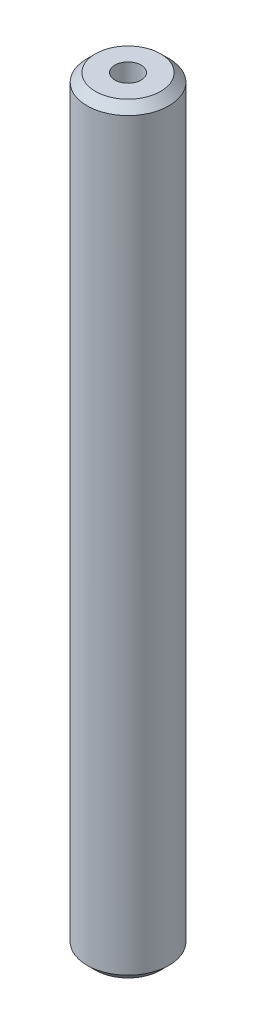
ISO-10303-21;
HEADER;
FILE_DESCRIPTION(('STEP AP214'),'2;1');
FILE_NAME('part.step','',(''),(''),'','','');
FILE_SCHEMA(('AUTOMOTIVE_DESIGN { 1 0 10303 214 1 1 1 1 }'));
ENDSEC;
DATA;
#1=APPLICATION_CONTEXT('core data for automotive mechanical design processes');
#2=APPLICATION_PROTOCOL_DEFINITION('international standard','automotive_design',2000,#1);
#3=PRODUCT_CONTEXT('',#1,'mechanical');
#4=PRODUCT('Part','Part','',(#3));
#5=PRODUCT_RELATED_PRODUCT_CATEGORY('part','',(#4));
#6=PRODUCT_DEFINITION_FORMATION('','',#4);
#7=PRODUCT_DEFINITION_CONTEXT('part definition',#1,'design');
#8=PRODUCT_DEFINITION('design','',#6,#7);
#9=PRODUCT_DEFINITION_SHAPE('','',#8);
#10=(LENGTH_UNIT() NAMED_UNIT(*) SI_UNIT(.MILLI.,.METRE.));
#11=(NAMED_UNIT(*) PLANE_ANGLE_UNIT() SI_UNIT($,.RADIAN.));
#12=(NAMED_UNIT(*) SI_UNIT($,.STERADIAN.) SOLID_ANGLE_UNIT());
#13=UNCERTAINTY_MEASURE_WITH_UNIT(LENGTH_MEASURE(1.E-05),#10,'distance_accuracy_value','');
#14=(GEOMETRIC_REPRESENTATION_CONTEXT(3) GLOBAL_UNCERTAINTY_ASSIGNED_CONTEXT((#13)) GLOBAL_UNIT_ASSIGNED_CONTEXT((#10,
#11,#12)) REPRESENTATION_CONTEXT('',''));
#15=CARTESIAN_POINT('',(0.,0.,0.));
#16=DIRECTION('',(0.,0.,1.));
#17=DIRECTION('',(1.,0.,0.));
#18=AXIS2_PLACEMENT_3D('',#15,#16,#17);
#19=CARTESIAN_POINT('',(0.,464.819685033356,0.));
#20=DIRECTION('',(0.,-1.,0.));
#21=DIRECTION('',(0.,0.,-1.));
#22=AXIS2_PLACEMENT_3D('',#19,#20,#21);
#23=CYLINDRICAL_SURFACE('',#22,25.);
#24=CARTESIAN_POINT('',(0.,459.739417993964,0.));
#25=DIRECTION('',(0.,1.,0.));
#26=DIRECTION('',(0.,0.,1.));
#27=AXIS2_PLACEMENT_3D('',#24,#25,#26);
#28=CIRCLE('',#27,25.);
#29=CARTESIAN_POINT('',(0.,459.739417993964,-25.));
#30=VERTEX_POINT('',#29);
#31=EDGE_CURVE('E50',#30,#30,#28,.F.);
#32=CARTESIAN_POINT('',(0.,5.08026703939218,0.));
#33=DIRECTION('',(0.,1.,0.));
#34=DIRECTION('',(0.,0.,1.));
#35=AXIS2_PLACEMENT_3D('',#32,#33,#34);
#36=CIRCLE('',#35,25.);
#37=CARTESIAN_POINT('',(0.,5.08026703939218,-25.));
#38=VERTEX_POINT('',#37);
#39=EDGE_CURVE('E51',#38,#38,#36,.T.);
#40=CARTESIAN_POINT('',(0.,459.739417993964,-25.));
#41=CARTESIAN_POINT('',(0.,455.003385171521,-25.));
#42=CARTESIAN_POINT('',(0.,450.267352349077,-25.));
#43=CARTESIAN_POINT('',(0.,440.79528670419,-25.));
#44=CARTESIAN_POINT('',(0.,436.059253881747,-25.));
#45=CARTESIAN_POINT('',(0.,426.58718823686,-25.));
#46=CARTESIAN_POINT('',(0.,421.851155414416,-25.));
#47=CARTESIAN_POINT('',(0.,412.379089769529,-25.));
#48=CARTESIAN_POINT('',(0.,407.643056947086,-25.));
#49=CARTESIAN_POINT('',(0.,398.170991302199,-25.));
#50=CARTESIAN_POINT('',(0.,393.434958479756,-25.));
#51=CARTESIAN_POINT('',(0.,383.962892834869,-25.));
#52=CARTESIAN_POINT('',(0.,379.226860012425,-25.));
#53=CARTESIAN_POINT('',(0.,369.754794367538,-25.));
#54=CARTESIAN_POINT('',(0.,365.018761545095,-25.));
#55=CARTESIAN_POINT('',(0.,355.546695900208,-25.));
#56=CARTESIAN_POINT('',(0.,350.810663077765,-25.));
#57=CARTESIAN_POINT('',(0.,341.338597432878,-25.));
#58=CARTESIAN_POINT('',(0.,336.602564610434,-25.));
#59=CARTESIAN_POINT('',(0.,327.130498965547,-25.));
#60=CARTESIAN_POINT('',(0.,322.394466143104,-25.));
#61=CARTESIAN_POINT('',(0.,312.922400498217,-25.));
#62=CARTESIAN_POINT('',(0.,308.186367675773,-25.));
#63=CARTESIAN_POINT('',(0.,298.714302030887,-25.));
#64=CARTESIAN_POINT('',(0.,293.978269208443,-25.));
#65=CARTESIAN_POINT('',(0.,284.506203563556,-25.));
#66=CARTESIAN_POINT('',(0.,279.770170741113,-25.));
#67=CARTESIAN_POINT('',(0.,270.298105096226,-25.));
#68=CARTESIAN_POINT('',(0.,265.562072273782,-25.));
#69=CARTESIAN_POINT('',(0.,256.090006628895,-25.));
#70=CARTESIAN_POINT('',(0.,251.353973806452,-25.));
#71=CARTESIAN_POINT('',(0.,241.881908161565,-25.));
#72=CARTESIAN_POINT('',(0.,237.145875339122,-25.));
#73=CARTESIAN_POINT('',(0.,227.673809694235,-25.));
#74=CARTESIAN_POINT('',(0.,222.937776871791,-25.));
#75=CARTESIAN_POINT('',(0.,213.465711226904,-25.));
#76=CARTESIAN_POINT('',(0.,208.729678404461,-25.));
#77=CARTESIAN_POINT('',(0.,199.257612759574,-25.));
#78=CARTESIAN_POINT('',(0.,194.52157993713,-25.));
#79=CARTESIAN_POINT('',(0.,185.049514292244,-25.));
#80=CARTESIAN_POINT('',(0.,180.3134814698,-25.));
#81=CARTESIAN_POINT('',(0.,170.841415824913,-25.));
#82=CARTESIAN_POINT('',(0.,166.10538300247,-25.));
#83=CARTESIAN_POINT('',(0.,156.633317357583,-25.));
#84=CARTESIAN_POINT('',(0.,151.897284535139,-25.));
#85=CARTESIAN_POINT('',(0.,142.425218890252,-25.));
#86=CARTESIAN_POINT('',(0.,137.689186067809,-25.));
#87=CARTESIAN_POINT('',(0.,128.217120422922,-25.));
#88=CARTESIAN_POINT('',(0.,123.481087600479,-25.));
#89=CARTESIAN_POINT('',(0.,114.009021955592,-25.));
#90=CARTESIAN_POINT('',(0.,109.272989133148,-25.));
#91=CARTESIAN_POINT('',(0.,99.8009234882613,-25.));
#92=CARTESIAN_POINT('',(0.,95.0648906658179,-25.));
#93=CARTESIAN_POINT('',(0.,85.5928250209309,-25.));
#94=CARTESIAN_POINT('',(0.,80.8567921984875,-25.));
#95=CARTESIAN_POINT('',(0.,71.3847265536006,-25.));
#96=CARTESIAN_POINT('',(0.,66.6486937311571,-25.));
#97=CARTESIAN_POINT('',(0.,57.1766280862702,-25.));
#98=CARTESIAN_POINT('',(0.,52.4405952638267,-25.));
#99=CARTESIAN_POINT('',(0.,42.9685296189398,-25.));
#100=CARTESIAN_POINT('',(0.,38.2324967964964,-25.));
#101=CARTESIAN_POINT('',(0.,28.7604311516095,-25.));
#102=CARTESIAN_POINT('',(0.,24.024398329166,-25.));
#103=CARTESIAN_POINT('',(0.,14.5523326842791,-25.));
#104=CARTESIAN_POINT('',(0.,9.81629986183563,-25.));
#105=CARTESIAN_POINT('',(0.,5.08026703939218,-25.));
#106=B_SPLINE_CURVE_WITH_KNOTS('',3,(#40,#41,#42,#43,#44,#45,#46,#47,#48,#49,#50,#51,#52,#53,
#54,#55,#56,#57,#58,#59,#60,#61,#62,#63,#64,#65,#66,#67,#68,#69,#70,#71,#72,#73,#74,#75,#76,#77,
#78,#79,#80,#81,#82,#83,#84,#85,#86,#87,#88,#89,#90,#91,#92,#93,#94,#95,#96,#97,#98,#99,#100,
#101,#102,#103,#104,#105),.UNSPECIFIED.,.F.,.F.,(4,2,2,2,2,2,2,2,2,2,2,2,2,2,2,2,2,2,2,2,2,2,2,
2,2,2,2,2,2,2,2,2,4),(0.,14.2080984673303,28.4161969346607,42.6242954019911,56.8323938693214,
71.0404923366518,85.2485908039822,99.4566892713125,113.664787738643,127.872886205973,
142.080984673304,156.289083140634,170.497181607964,184.705280075295,198.913378542625,
213.121477009955,227.329575477286,241.537673944616,255.745772411947,269.953870879277,
284.161969346607,298.370067813938,312.578166281268,326.786264748598,340.994363215929,
355.202461683259,369.41056015059,383.61865861792,397.82675708525,412.034855552581,
426.242954019911,440.451052487241,454.659150954572),.UNSPECIFIED.);
#107=EDGE_CURVE('BSEAM39',#30,#38,#106,.T.);
#108=ORIENTED_EDGE('',*,*,#31,.T.);
#109=ORIENTED_EDGE('',*,*,#39,.T.);
#110=ORIENTED_EDGE('',*,*,#107,.T.);
#111=ORIENTED_EDGE('',*,*,#107,.F.);
#112=EDGE_LOOP('',(#108,#110,#109,#111));
#113=FACE_BOUND('',#112,.T.);
#114=ADVANCED_FACE('F39',(#113),#23,.T.);
#115=CARTESIAN_POINT('',(0.,464.819685033356,0.));
#116=DIRECTION('',(0.,1.,0.));
#117=DIRECTION('',(0.,0.,1.));
#118=AXIS2_PLACEMENT_3D('',#115,#116,#117);
#119=PLANE('',#118);
#120=CARTESIAN_POINT('',(0.,464.819685033356,0.));
#121=DIRECTION('',(0.,1.,0.));
#122=DIRECTION('',(0.,0.,1.));
#123=AXIS2_PLACEMENT_3D('',#120,#121,#122);
#124=CIRCLE('',#123,19.9197329606084);
#125=CARTESIAN_POINT('',(0.,464.819685033356,19.9197329606084));
#126=VERTEX_POINT('',#125);
#127=EDGE_CURVE('E54',#126,#126,#124,.T.);
#128=ORIENTED_EDGE('',*,*,#127,.T.);
#129=EDGE_LOOP('',(#128));
#130=FACE_BOUND('',#129,.T.);
#131=CARTESIAN_POINT('',(0.,464.819685033356,0.));
#132=DIRECTION('',(0.,1.,0.));
#133=DIRECTION('',(0.,0.,1.));
#134=AXIS2_PLACEMENT_3D('',#131,#132,#133);
#135=CIRCLE('',#134,7.98255586034848);
#136=CARTESIAN_POINT('',(0.,464.819685033356,-7.98255586034848));
#137=VERTEX_POINT('',#136);
#138=EDGE_CURVE('E58',#137,#137,#135,.T.);
#139=ORIENTED_EDGE('',*,*,#138,.F.);
#140=EDGE_LOOP('',(#139));
#141=FACE_BOUND('',#140,.T.);
#142=ADVANCED_FACE('F69',(#130,#141),#119,.T.);
#143=CARTESIAN_POINT('',(0.,0.,0.));
#144=DIRECTION('',(0.,1.,0.));
#145=DIRECTION('',(0.,0.,1.));
#146=AXIS2_PLACEMENT_3D('',#143,#144,#145);
#147=PLANE('',#146);
#148=CARTESIAN_POINT('',(0.,0.,0.));
#149=DIRECTION('',(0.,1.,0.));
#150=DIRECTION('',(0.,0.,1.));
#151=AXIS2_PLACEMENT_3D('',#148,#149,#150);
#152=CIRCLE('',#151,19.9197329606078);
#153=CARTESIAN_POINT('',(0.,0.,19.9197329606078));
#154=VERTEX_POINT('',#153);
#155=EDGE_CURVE('E10',#154,#154,#152,.F.);
#156=ORIENTED_EDGE('',*,*,#155,.T.);
#157=EDGE_LOOP('',(#156));
#158=FACE_BOUND('',#157,.T.);
#159=CARTESIAN_POINT('',(0.,0.,0.));
#160=DIRECTION('',(0.,1.,0.));
#161=DIRECTION('',(0.,0.,1.));
#162=AXIS2_PLACEMENT_3D('',#159,#160,#161);
#163=CIRCLE('',#162,7.98255586034848);
#164=CARTESIAN_POINT('',(0.,0.,-7.98255586034848));
#165=VERTEX_POINT('',#164);
#166=EDGE_CURVE('E63',#165,#165,#163,.T.);
#167=ORIENTED_EDGE('',*,*,#166,.T.);
#168=EDGE_LOOP('',(#167));
#169=FACE_BOUND('',#168,.T.);
#170=ADVANCED_FACE('F75',(#158,#169),#147,.F.);
#171=CARTESIAN_POINT('',(0.,464.819685033356,0.));
#172=DIRECTION('',(0.,-1.,0.));
#173=DIRECTION('',(0.,0.,-1.));
#174=AXIS2_PLACEMENT_3D('',#171,#172,#173);
#175=CYLINDRICAL_SURFACE('',#174,7.98255586034848);
#176=CARTESIAN_POINT('',(0.,464.819685033356,-7.98255586034848));
#177=CARTESIAN_POINT('',(0.,459.977813314258,-7.98255586034848));
#178=CARTESIAN_POINT('',(0.,455.135941595161,-7.98255586034848));
#179=CARTESIAN_POINT('',(0.,445.452198156966,-7.98255586034848));
#180=CARTESIAN_POINT('',(0.,440.610326437868,-7.98255586034848));
#181=CARTESIAN_POINT('',(0.,430.926582999673,-7.98255586034848));
#182=CARTESIAN_POINT('',(0.,426.084711280576,-7.98255586034848));
#183=CARTESIAN_POINT('',(0.,416.400967842381,-7.98255586034848));
#184=CARTESIAN_POINT('',(0.,411.559096123284,-7.98255586034848));
#185=CARTESIAN_POINT('',(0.,401.875352685089,-7.98255586034848));
#186=CARTESIAN_POINT('',(0.,397.033480965991,-7.98255586034848));
#187=CARTESIAN_POINT('',(0.,387.349737527796,-7.98255586034848));
#188=CARTESIAN_POINT('',(0.,382.507865808699,-7.98255586034848));
#189=CARTESIAN_POINT('',(0.,372.824122370504,-7.98255586034848));
#190=CARTESIAN_POINT('',(0.,367.982250651406,-7.98255586034848));
#191=CARTESIAN_POINT('',(0.,358.298507213212,-7.98255586034848));
#192=CARTESIAN_POINT('',(0.,353.456635494114,-7.98255586034848));
#193=CARTESIAN_POINT('',(0.,343.772892055919,-7.98255586034848));
#194=CARTESIAN_POINT('',(0.,338.931020336822,-7.98255586034848));
#195=CARTESIAN_POINT('',(0.,329.247276898627,-7.98255586034848));
#196=CARTESIAN_POINT('',(0.,324.405405179529,-7.98255586034848));
#197=CARTESIAN_POINT('',(0.,314.721661741334,-7.98255586034848));
#198=CARTESIAN_POINT('',(0.,309.879790022237,-7.98255586034848));
#199=CARTESIAN_POINT('',(0.,300.196046584042,-7.98255586034848));
#200=CARTESIAN_POINT('',(0.,295.354174864945,-7.98255586034848));
#201=CARTESIAN_POINT('',(0.,285.67043142675,-7.98255586034848));
#202=CARTESIAN_POINT('',(0.,280.828559707652,-7.98255586034848));
#203=CARTESIAN_POINT('',(0.,271.144816269457,-7.98255586034848));
#204=CARTESIAN_POINT('',(0.,266.30294455036,-7.98255586034848));
#205=CARTESIAN_POINT('',(0.,256.619201112165,-7.98255586034848));
#206=CARTESIAN_POINT('',(0.,251.777329393068,-7.98255586034848));
#207=CARTESIAN_POINT('',(0.,242.093585954873,-7.98255586034848));
#208=CARTESIAN_POINT('',(0.,237.251714235775,-7.98255586034848));
#209=CARTESIAN_POINT('',(0.,227.56797079758,-7.98255586034848));
#210=CARTESIAN_POINT('',(0.,222.726099078483,-7.98255586034848));
#211=CARTESIAN_POINT('',(0.,213.042355640288,-7.98255586034848));
#212=CARTESIAN_POINT('',(0.,208.200483921191,-7.98255586034848));
#213=CARTESIAN_POINT('',(0.,198.516740482996,-7.98255586034848));
#214=CARTESIAN_POINT('',(0.,193.674868763898,-7.98255586034848));
#215=CARTESIAN_POINT('',(0.,183.991125325703,-7.98255586034848));
#216=CARTESIAN_POINT('',(0.,179.149253606606,-7.98255586034848));
#217=CARTESIAN_POINT('',(0.,169.465510168411,-7.98255586034848));
#218=CARTESIAN_POINT('',(0.,164.623638449313,-7.98255586034848));
#219=CARTESIAN_POINT('',(0.,154.939895011119,-7.98255586034848));
#220=CARTESIAN_POINT('',(0.,150.098023292021,-7.98255586034848));
#221=CARTESIAN_POINT('',(0.,140.414279853826,-7.98255586034848));
#222=CARTESIAN_POINT('',(0.,135.572408134729,-7.98255586034848));
#223=CARTESIAN_POINT('',(0.,125.888664696534,-7.98255586034848));
#224=CARTESIAN_POINT('',(0.,121.046792977436,-7.98255586034848));
#225=CARTESIAN_POINT('',(0.,111.363049539241,-7.98255586034848));
#226=CARTESIAN_POINT('',(0.,106.521177820144,-7.98255586034848));
#227=CARTESIAN_POINT('',(0.,96.8374343819491,-7.98255586034848));
#228=CARTESIAN_POINT('',(0.,91.9955626628516,-7.98255586034848));
#229=CARTESIAN_POINT('',(0.,82.3118192246567,-7.98255586034848));
#230=CARTESIAN_POINT('',(0.,77.4699475055592,-7.98255586034848));
#231=CARTESIAN_POINT('',(0.,67.7862040673643,-7.98255586034848));
#232=CARTESIAN_POINT('',(0.,62.9443323482669,-7.98255586034848));
#233=CARTESIAN_POINT('',(0.,53.260588910072,-7.98255586034848));
#234=CARTESIAN_POINT('',(0.,48.4187171909745,-7.98255586034848));
#235=CARTESIAN_POINT('',(0.,38.7349737527796,-7.98255586034848));
#236=CARTESIAN_POINT('',(0.,33.8931020336821,-7.98255586034848));
#237=CARTESIAN_POINT('',(0.,24.2093585954872,-7.98255586034848));
#238=CARTESIAN_POINT('',(0.,19.3674868763897,-7.98255586034848));
#239=CARTESIAN_POINT('',(0.,9.68374343819484,-7.98255586034848));
#240=CARTESIAN_POINT('',(0.,4.84187171909739,-7.98255586034848));
#241=CARTESIAN_POINT('',(0.,0.,-7.98255586034848));
#242=B_SPLINE_CURVE_WITH_KNOTS('',3,(#176,#177,#178,#179,#180,#181,#182,#183,#184,#185,#186,
#187,#188,#189,#190,#191,#192,#193,#194,#195,#196,#197,#198,#199,#200,#201,#202,#203,#204,#205,
#206,#207,#208,#209,#210,#211,#212,#213,#214,#215,#216,#217,#218,#219,#220,#221,#222,#223,#224,
#225,#226,#227,#228,#229,#230,#231,#232,#233,#234,#235,#236,#237,#238,#239,#240,#241),
.UNSPECIFIED.,.F.,.F.,(4,2,2,2,2,2,2,2,2,2,2,2,2,2,2,2,2,2,2,2,2,2,2,2,2,2,2,2,2,2,2,2,4),(0.,
14.5256151572924,29.0512303145847,43.5768454718771,58.1024606291695,72.6280757864618,
87.1536909437542,101.679306101047,116.204921258339,130.730536415631,145.256151572924,
159.781766730216,174.307381887508,188.832997044801,203.358612202093,217.884227359385,
232.409842516678,246.93545767397,261.461072831263,275.986687988555,290.512303145847,
305.03791830314,319.563533460432,334.089148617724,348.614763775017,363.140378932309,
377.665994089601,392.191609246894,406.717224404186,421.242839561478,435.768454718771,
450.294069876063,464.819685033356),.UNSPECIFIED.);
#243=EDGE_CURVE('BSEAM70',#137,#165,#242,.T.);
#244=ORIENTED_EDGE('',*,*,#138,.T.);
#245=ORIENTED_EDGE('',*,*,#166,.F.);
#246=ORIENTED_EDGE('',*,*,#243,.T.);
#247=ORIENTED_EDGE('',*,*,#243,.F.);
#248=EDGE_LOOP('',(#244,#246,#245,#247));
#249=FACE_BOUND('',#248,.T.);
#250=ADVANCED_FACE('F70',(#249),#175,.F.);
#251=CARTESIAN_POINT('',(0.,464.819685033356,0.));
#252=DIRECTION('',(0.,-1.,0.));
#253=DIRECTION('',(0.,0.,-1.));
#254=AXIS2_PLACEMENT_3D('',#251,#252,#253);
#255=CONICAL_SURFACE('',#254,19.9197329606084,0.785398163397447);
#256=ORIENTED_EDGE('',*,*,#31,.F.);
#257=EDGE_LOOP('',(#256));
#258=FACE_BOUND('',#257,.T.);
#259=ORIENTED_EDGE('',*,*,#127,.F.);
#260=EDGE_LOOP('',(#259));
#261=FACE_BOUND('',#260,.T.);
#262=ADVANCED_FACE('F81',(#258,#261),#255,.T.);
#263=CARTESIAN_POINT('',(0.,5.08026703939218,0.));
#264=DIRECTION('',(0.,1.,0.));
#265=DIRECTION('',(0.,0.,1.));
#266=AXIS2_PLACEMENT_3D('',#263,#264,#265);
#267=CONICAL_SURFACE('',#266,25.,0.785398163397452);
#268=ORIENTED_EDGE('',*,*,#155,.F.);
#269=EDGE_LOOP('',(#268));
#270=FACE_BOUND('',#269,.T.);
#271=ORIENTED_EDGE('',*,*,#39,.F.);
#272=EDGE_LOOP('',(#271));
#273=FACE_BOUND('',#272,.T.);
#274=ADVANCED_FACE('F45',(#270,#273),#267,.T.);
#275=CLOSED_SHELL('',(#114,#142,#170,#250,#262,#274));
#276=MANIFOLD_SOLID_BREP('B2',#275);
#277=ADVANCED_BREP_SHAPE_REPRESENTATION('',(#18,#276),#14);
#278=SHAPE_DEFINITION_REPRESENTATION(#9,#277);
ENDSEC;
END-ISO-10303-21;
